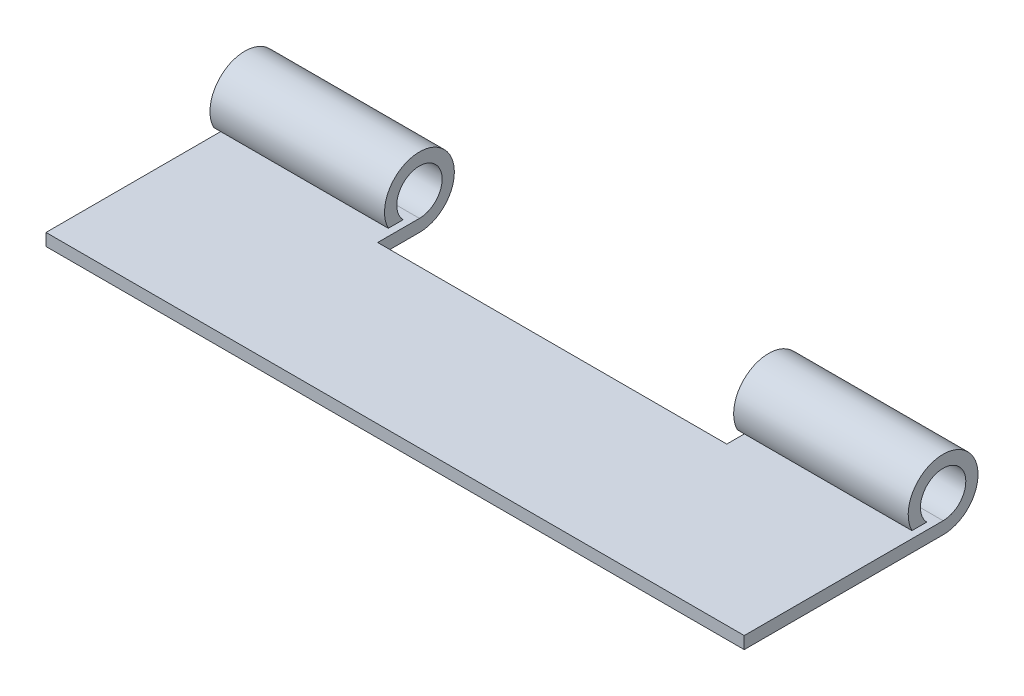
ISO-10303-21;
HEADER;
FILE_DESCRIPTION(('STEP AP214'),'2;1');
FILE_NAME('part.step','',(''),(''),'','','');
FILE_SCHEMA(('AUTOMOTIVE_DESIGN { 1 0 10303 214 1 1 1 1 }'));
ENDSEC;
DATA;
#1=APPLICATION_CONTEXT('core data for automotive mechanical design processes');
#2=APPLICATION_PROTOCOL_DEFINITION('international standard','automotive_design',2000,#1);
#3=PRODUCT_CONTEXT('',#1,'mechanical');
#4=PRODUCT('Part','Part','',(#3));
#5=PRODUCT_RELATED_PRODUCT_CATEGORY('part','',(#4));
#6=PRODUCT_DEFINITION_FORMATION('','',#4);
#7=PRODUCT_DEFINITION_CONTEXT('part definition',#1,'design');
#8=PRODUCT_DEFINITION('design','',#6,#7);
#9=PRODUCT_DEFINITION_SHAPE('','',#8);
#10=(LENGTH_UNIT() NAMED_UNIT(*) SI_UNIT(.MILLI.,.METRE.));
#11=(NAMED_UNIT(*) PLANE_ANGLE_UNIT() SI_UNIT($,.RADIAN.));
#12=(NAMED_UNIT(*) SI_UNIT($,.STERADIAN.) SOLID_ANGLE_UNIT());
#13=UNCERTAINTY_MEASURE_WITH_UNIT(LENGTH_MEASURE(1.E-05),#10,'distance_accuracy_value','');
#14=(GEOMETRIC_REPRESENTATION_CONTEXT(3) GLOBAL_UNCERTAINTY_ASSIGNED_CONTEXT((#13)) GLOBAL_UNIT_ASSIGNED_CONTEXT((#10,
#11,#12)) REPRESENTATION_CONTEXT('',''));
#15=CARTESIAN_POINT('',(0.,0.,0.));
#16=DIRECTION('',(0.,0.,1.));
#17=DIRECTION('',(1.,0.,0.));
#18=AXIS2_PLACEMENT_3D('',#15,#16,#17);
#19=CARTESIAN_POINT('',(0.,0.889,0.));
#20=DIRECTION('',(1.,0.,0.));
#21=DIRECTION('',(0.,0.,-1.));
#22=AXIS2_PLACEMENT_3D('',#19,#20,#21);
#23=PLANE('',#22);
#24=DIRECTION('',(0.,0.,1.));
#25=VECTOR('',#24,1.);
#26=CARTESIAN_POINT('',(0.,0.,0.));
#27=LINE('',#26,#25);
#28=CARTESIAN_POINT('',(0.,0.,-18.9150541552965));
#29=VERTEX_POINT('',#28);
#30=CARTESIAN_POINT('',(0.,0.,-4.445));
#31=VERTEX_POINT('',#30);
#32=EDGE_CURVE('E240',#29,#31,#27,.T.);
#33=ORIENTED_EDGE('',*,*,#32,.T.);
#34=DIRECTION('',(0.,1.,0.));
#35=VECTOR('',#34,1.);
#36=CARTESIAN_POINT('',(0.,6.34032173325027,-4.445));
#37=LINE('',#36,#35);
#38=CARTESIAN_POINT('',(0.,0.889,-4.445));
#39=VERTEX_POINT('',#38);
#40=EDGE_CURVE('E230',#31,#39,#37,.T.);
#41=ORIENTED_EDGE('',*,*,#40,.T.);
#42=DIRECTION('',(0.,0.,1.));
#43=VECTOR('',#42,1.);
#44=CARTESIAN_POINT('',(0.,0.889,0.));
#45=LINE('',#44,#43);
#46=CARTESIAN_POINT('',(0.,0.889000000000001,-18.9150541552965));
#47=VERTEX_POINT('',#46);
#48=EDGE_CURVE('E241',#47,#39,#45,.T.);
#49=ORIENTED_EDGE('',*,*,#48,.F.);
#50=CARTESIAN_POINT('',(0.,2.54,-18.9150541552965));
#51=DIRECTION('',(1.,0.,0.));
#52=DIRECTION('',(0.,0.,-1.));
#53=AXIS2_PLACEMENT_3D('',#50,#51,#52);
#54=CIRCLE('',#53,1.651);
#55=CARTESIAN_POINT('',(0.,1.397,-17.7236885523013));
#56=VERTEX_POINT('',#55);
#57=EDGE_CURVE('E173',#47,#56,#54,.T.);
#58=ORIENTED_EDGE('',*,*,#57,.T.);
#59=DIRECTION('',(0.,0.,1.));
#60=VECTOR('',#59,1.);
#61=CARTESIAN_POINT('',(0.,1.397,-16.646761625661));
#62=LINE('',#61,#60);
#63=CARTESIAN_POINT('',(0.,1.397,-16.646761625661));
#64=VERTEX_POINT('',#63);
#65=EDGE_CURVE('E179',#56,#64,#62,.T.);
#66=ORIENTED_EDGE('',*,*,#65,.T.);
#67=CARTESIAN_POINT('',(0.,2.54,-18.9150541552965));
#68=DIRECTION('',(1.,0.,0.));
#69=DIRECTION('',(0.,0.,-1.));
#70=AXIS2_PLACEMENT_3D('',#67,#68,#69);
#71=CIRCLE('',#70,2.54);
#72=EDGE_CURVE('E136',#64,#29,#71,.F.);
#73=ORIENTED_EDGE('',*,*,#72,.T.);
#74=EDGE_LOOP('',(#33,#41,#49,#58,#66,#73));
#75=FACE_BOUND('',#74,.T.);
#76=ADVANCED_FACE('F39',(#75),#23,.F.);
#77=CARTESIAN_POINT('',(50.8,0.889,0.));
#78=DIRECTION('',(-1.,0.,0.));
#79=DIRECTION('',(0.,0.,1.));
#80=AXIS2_PLACEMENT_3D('',#77,#78,#79);
#81=PLANE('',#80);
#82=DIRECTION('',(0.,0.,-1.));
#83=VECTOR('',#82,1.);
#84=CARTESIAN_POINT('',(50.8,0.889,0.));
#85=LINE('',#84,#83);
#86=CARTESIAN_POINT('',(50.8,0.889,-4.445));
#87=VERTEX_POINT('',#86);
#88=CARTESIAN_POINT('',(50.8,0.889000000000001,-18.9150541552965));
#89=VERTEX_POINT('',#88);
#90=EDGE_CURVE('E245',#87,#89,#85,.T.);
#91=ORIENTED_EDGE('',*,*,#90,.F.);
#92=DIRECTION('',(0.,1.,0.));
#93=VECTOR('',#92,1.);
#94=CARTESIAN_POINT('',(50.8,6.34032173325027,-4.445));
#95=LINE('',#94,#93);
#96=CARTESIAN_POINT('',(50.8,0.,-4.445));
#97=VERTEX_POINT('',#96);
#98=EDGE_CURVE('E229',#97,#87,#95,.T.);
#99=ORIENTED_EDGE('',*,*,#98,.F.);
#100=DIRECTION('',(0.,0.,-1.));
#101=VECTOR('',#100,1.);
#102=CARTESIAN_POINT('',(50.8,0.,0.));
#103=LINE('',#102,#101);
#104=CARTESIAN_POINT('',(50.8,0.,-18.9150541552965));
#105=VERTEX_POINT('',#104);
#106=EDGE_CURVE('E253',#97,#105,#103,.T.);
#107=ORIENTED_EDGE('',*,*,#106,.T.);
#108=CARTESIAN_POINT('',(50.8,2.54,-18.9150541552965));
#109=DIRECTION('',(-1.,0.,0.));
#110=DIRECTION('',(0.,0.,1.));
#111=AXIS2_PLACEMENT_3D('',#108,#109,#110);
#112=CIRCLE('',#111,2.54);
#113=CARTESIAN_POINT('',(50.8,1.397,-16.646761625661));
#114=VERTEX_POINT('',#113);
#115=EDGE_CURVE('E187',#114,#105,#112,.T.);
#116=ORIENTED_EDGE('',*,*,#115,.F.);
#117=DIRECTION('',(0.,0.,1.));
#118=VECTOR('',#117,1.);
#119=CARTESIAN_POINT('',(50.8,1.397,-16.646761625661));
#120=LINE('',#119,#118);
#121=CARTESIAN_POINT('',(50.8,1.397,-17.7236885523013));
#122=VERTEX_POINT('',#121);
#123=EDGE_CURVE('E183',#122,#114,#120,.T.);
#124=ORIENTED_EDGE('',*,*,#123,.F.);
#125=CARTESIAN_POINT('',(50.8,2.54,-18.9150541552965));
#126=DIRECTION('',(-1.,0.,0.));
#127=DIRECTION('',(0.,0.,1.));
#128=AXIS2_PLACEMENT_3D('',#125,#126,#127);
#129=CIRCLE('',#128,1.651);
#130=EDGE_CURVE('E192',#122,#89,#129,.T.);
#131=ORIENTED_EDGE('',*,*,#130,.T.);
#132=EDGE_LOOP('',(#91,#99,#107,#116,#124,#131));
#133=FACE_BOUND('',#132,.T.);
#134=ADVANCED_FACE('F279',(#133),#81,.F.);
#135=CARTESIAN_POINT('',(0.,0.889,-15.875));
#136=DIRECTION('',(0.,0.,1.));
#137=DIRECTION('',(1.,0.,0.));
#138=AXIS2_PLACEMENT_3D('',#135,#136,#137);
#139=PLANE('',#138);
#140=DIRECTION('',(-1.,0.,0.));
#141=VECTOR('',#140,1.);
#142=CARTESIAN_POINT('',(0.,0.,-15.875));
#143=LINE('',#142,#141);
#144=CARTESIAN_POINT('',(38.1,0.,-15.875));
#145=VERTEX_POINT('',#144);
#146=CARTESIAN_POINT('',(12.7,0.,-15.875));
#147=VERTEX_POINT('',#146);
#148=EDGE_CURVE('E59',#145,#147,#143,.T.);
#149=ORIENTED_EDGE('',*,*,#148,.T.);
#150=DIRECTION('',(0.,-1.,0.));
#151=VECTOR('',#150,1.);
#152=CARTESIAN_POINT('',(12.7,0.889,-15.875));
#153=LINE('',#152,#151);
#154=CARTESIAN_POINT('',(12.7,0.889,-15.875));
#155=VERTEX_POINT('',#154);
#156=EDGE_CURVE('E54',#155,#147,#153,.T.);
#157=ORIENTED_EDGE('',*,*,#156,.F.);
#158=DIRECTION('',(-1.,0.,0.));
#159=VECTOR('',#158,1.);
#160=CARTESIAN_POINT('',(0.,0.889,-15.875));
#161=LINE('',#160,#159);
#162=CARTESIAN_POINT('',(38.1,0.889,-15.875));
#163=VERTEX_POINT('',#162);
#164=EDGE_CURVE('E47',#163,#155,#161,.T.);
#165=ORIENTED_EDGE('',*,*,#164,.F.);
#166=DIRECTION('',(0.,-1.,0.));
#167=VECTOR('',#166,1.);
#168=CARTESIAN_POINT('',(38.1,0.889,-15.875));
#169=LINE('',#168,#167);
#170=EDGE_CURVE('E212',#163,#145,#169,.T.);
#171=ORIENTED_EDGE('',*,*,#170,.T.);
#172=EDGE_LOOP('',(#149,#157,#165,#171));
#173=FACE_BOUND('',#172,.T.);
#174=ADVANCED_FACE('F267',(#173),#139,.F.);
#175=CARTESIAN_POINT('',(0.,0.889,0.));
#176=DIRECTION('',(0.,-1.,0.));
#177=DIRECTION('',(0.,0.,-1.));
#178=AXIS2_PLACEMENT_3D('',#175,#176,#177);
#179=PLANE('',#178);
#180=ORIENTED_EDGE('',*,*,#48,.T.);
#181=DIRECTION('',(1.,0.,0.));
#182=VECTOR('',#181,1.);
#183=CARTESIAN_POINT('',(0.,0.889,-4.445));
#184=LINE('',#183,#182);
#185=EDGE_CURVE('E234',#39,#87,#184,.T.);
#186=ORIENTED_EDGE('',*,*,#185,.T.);
#187=ORIENTED_EDGE('',*,*,#90,.T.);
#188=DIRECTION('',(-1.,0.,0.));
#189=VECTOR('',#188,1.);
#190=CARTESIAN_POINT('',(58.3460853676619,0.889000000000001,-18.9150541552965));
#191=LINE('',#190,#189);
#192=CARTESIAN_POINT('',(38.1,0.889000000000001,-18.9150541552965));
#193=VERTEX_POINT('',#192);
#194=EDGE_CURVE('E215',#89,#193,#191,.T.);
#195=ORIENTED_EDGE('',*,*,#194,.T.);
#196=DIRECTION('',(0.,0.,-1.));
#197=VECTOR('',#196,1.);
#198=CARTESIAN_POINT('',(38.1,0.889,-15.875));
#199=LINE('',#198,#197);
#200=EDGE_CURVE('E182',#163,#193,#199,.T.);
#201=ORIENTED_EDGE('',*,*,#200,.F.);
#202=ORIENTED_EDGE('',*,*,#164,.T.);
#203=DIRECTION('',(0.,0.,1.));
#204=VECTOR('',#203,1.);
#205=CARTESIAN_POINT('',(12.7,0.889,-15.875));
#206=LINE('',#205,#204);
#207=CARTESIAN_POINT('',(12.7,0.889,-18.9150541552965));
#208=VERTEX_POINT('',#207);
#209=EDGE_CURVE('E162',#208,#155,#206,.T.);
#210=ORIENTED_EDGE('',*,*,#209,.F.);
#211=DIRECTION('',(1.,0.,0.));
#212=VECTOR('',#211,1.);
#213=CARTESIAN_POINT('',(-7.54608536766194,0.889,-18.9150541552965));
#214=LINE('',#213,#212);
#215=EDGE_CURVE('E174',#47,#208,#214,.T.);
#216=ORIENTED_EDGE('',*,*,#215,.F.);
#217=EDGE_LOOP('',(#180,#186,#187,#195,#201,#202,#210,#216));
#218=FACE_BOUND('',#217,.T.);
#219=ADVANCED_FACE('F265',(#218),#179,.F.);
#220=CARTESIAN_POINT('',(0.,0.,0.));
#221=DIRECTION('',(0.,-1.,0.));
#222=DIRECTION('',(0.,0.,-1.));
#223=AXIS2_PLACEMENT_3D('',#220,#221,#222);
#224=PLANE('',#223);
#225=DIRECTION('',(1.,0.,0.));
#226=VECTOR('',#225,1.);
#227=CARTESIAN_POINT('',(0.,0.,-4.445));
#228=LINE('',#227,#226);
#229=EDGE_CURVE('E11',#31,#97,#228,.T.);
#230=ORIENTED_EDGE('',*,*,#229,.F.);
#231=ORIENTED_EDGE('',*,*,#32,.F.);
#232=DIRECTION('',(1.,0.,0.));
#233=VECTOR('',#232,1.);
#234=CARTESIAN_POINT('',(-7.54608536766194,0.,-18.9150541552965));
#235=LINE('',#234,#233);
#236=CARTESIAN_POINT('',(12.7,0.,-18.9150541552965));
#237=VERTEX_POINT('',#236);
#238=EDGE_CURVE('E170',#29,#237,#235,.T.);
#239=ORIENTED_EDGE('',*,*,#238,.T.);
#240=DIRECTION('',(0.,0.,-1.));
#241=VECTOR('',#240,1.);
#242=CARTESIAN_POINT('',(12.7,0.,-15.875));
#243=LINE('',#242,#241);
#244=EDGE_CURVE('E141',#147,#237,#243,.T.);
#245=ORIENTED_EDGE('',*,*,#244,.F.);
#246=ORIENTED_EDGE('',*,*,#148,.F.);
#247=DIRECTION('',(0.,0.,-1.));
#248=VECTOR('',#247,1.);
#249=CARTESIAN_POINT('',(38.1,0.,-15.875));
#250=LINE('',#249,#248);
#251=CARTESIAN_POINT('',(38.1,0.,-18.9150541552965));
#252=VERTEX_POINT('',#251);
#253=EDGE_CURVE('E208',#145,#252,#250,.T.);
#254=ORIENTED_EDGE('',*,*,#253,.T.);
#255=DIRECTION('',(-1.,0.,0.));
#256=VECTOR('',#255,1.);
#257=CARTESIAN_POINT('',(58.3460853676619,0.,-18.9150541552965));
#258=LINE('',#257,#256);
#259=EDGE_CURVE('E188',#105,#252,#258,.T.);
#260=ORIENTED_EDGE('',*,*,#259,.F.);
#261=ORIENTED_EDGE('',*,*,#106,.F.);
#262=EDGE_LOOP('',(#230,#231,#239,#245,#246,#254,#260,#261));
#263=FACE_BOUND('',#262,.T.);
#264=ADVANCED_FACE('F271',(#263),#224,.T.);
#265=CARTESIAN_POINT('',(0.,6.34032173325027,-4.445));
#266=DIRECTION('',(0.,0.,-1.));
#267=DIRECTION('',(0.,1.,0.));
#268=AXIS2_PLACEMENT_3D('',#265,#266,#267);
#269=PLANE('',#268);
#270=ORIENTED_EDGE('',*,*,#40,.F.);
#271=ORIENTED_EDGE('',*,*,#229,.T.);
#272=ORIENTED_EDGE('',*,*,#98,.T.);
#273=ORIENTED_EDGE('',*,*,#185,.F.);
#274=EDGE_LOOP('',(#270,#271,#272,#273));
#275=FACE_BOUND('',#274,.T.);
#276=ADVANCED_FACE('F309',(#275),#269,.F.);
#277=CARTESIAN_POINT('',(58.3460853676619,2.54,-18.9150541552965));
#278=DIRECTION('',(-1.,0.,0.));
#279=DIRECTION('',(0.,0.,1.));
#280=AXIS2_PLACEMENT_3D('',#277,#278,#279);
#281=CYLINDRICAL_SURFACE('',#280,2.54);
#282=DIRECTION('',(-1.,0.,0.));
#283=VECTOR('',#282,1.);
#284=CARTESIAN_POINT('',(58.3460853676619,1.397,-16.646761625661));
#285=LINE('',#284,#283);
#286=CARTESIAN_POINT('',(38.1,1.397,-16.646761625661));
#287=VERTEX_POINT('',#286);
#288=EDGE_CURVE('E218',#114,#287,#285,.T.);
#289=ORIENTED_EDGE('',*,*,#288,.F.);
#290=ORIENTED_EDGE('',*,*,#115,.T.);
#291=ORIENTED_EDGE('',*,*,#259,.T.);
#292=CARTESIAN_POINT('',(38.1,2.54,-18.9150541552965));
#293=DIRECTION('',(1.,0.,0.));
#294=DIRECTION('',(0.,0.,-1.));
#295=AXIS2_PLACEMENT_3D('',#292,#293,#294);
#296=CIRCLE('',#295,2.54);
#297=EDGE_CURVE('E204',#252,#287,#296,.T.);
#298=ORIENTED_EDGE('',*,*,#297,.T.);
#299=EDGE_LOOP('',(#289,#290,#291,#298));
#300=FACE_BOUND('',#299,.T.);
#301=ADVANCED_FACE('F313',(#300),#281,.T.);
#302=CARTESIAN_POINT('',(58.3460853676619,1.397,-16.646761625661));
#303=DIRECTION('',(0.,1.,0.));
#304=DIRECTION('',(0.,0.,1.));
#305=AXIS2_PLACEMENT_3D('',#302,#303,#304);
#306=PLANE('',#305);
#307=DIRECTION('',(-1.,0.,0.));
#308=VECTOR('',#307,1.);
#309=CARTESIAN_POINT('',(58.3460853676619,1.397,-17.7236885523013));
#310=LINE('',#309,#308);
#311=CARTESIAN_POINT('',(38.1,1.397,-17.7236885523013));
#312=VERTEX_POINT('',#311);
#313=EDGE_CURVE('E221',#122,#312,#310,.T.);
#314=ORIENTED_EDGE('',*,*,#313,.F.);
#315=ORIENTED_EDGE('',*,*,#123,.T.);
#316=ORIENTED_EDGE('',*,*,#288,.T.);
#317=DIRECTION('',(0.,0.,-1.));
#318=VECTOR('',#317,1.);
#319=CARTESIAN_POINT('',(38.1,1.397,-16.646761625661));
#320=LINE('',#319,#318);
#321=EDGE_CURVE('E200',#287,#312,#320,.T.);
#322=ORIENTED_EDGE('',*,*,#321,.T.);
#323=EDGE_LOOP('',(#314,#315,#316,#322));
#324=FACE_BOUND('',#323,.T.);
#325=ADVANCED_FACE('F295',(#324),#306,.F.);
#326=CARTESIAN_POINT('',(58.3460853676619,2.54,-18.9150541552965));
#327=DIRECTION('',(-1.,0.,0.));
#328=DIRECTION('',(0.,0.,1.));
#329=AXIS2_PLACEMENT_3D('',#326,#327,#328);
#330=CYLINDRICAL_SURFACE('',#329,1.651);
#331=ORIENTED_EDGE('',*,*,#130,.F.);
#332=ORIENTED_EDGE('',*,*,#313,.T.);
#333=CARTESIAN_POINT('',(38.1,2.54,-18.9150541552965));
#334=DIRECTION('',(1.,0.,0.));
#335=DIRECTION('',(0.,0.,-1.));
#336=AXIS2_PLACEMENT_3D('',#333,#334,#335);
#337=CIRCLE('',#336,1.651);
#338=EDGE_CURVE('E196',#193,#312,#337,.T.);
#339=ORIENTED_EDGE('',*,*,#338,.F.);
#340=ORIENTED_EDGE('',*,*,#194,.F.);
#341=EDGE_LOOP('',(#331,#332,#339,#340));
#342=FACE_BOUND('',#341,.T.);
#343=ADVANCED_FACE('F285',(#342),#330,.F.);
#344=CARTESIAN_POINT('',(38.1,2.54,-18.9150541552965));
#345=DIRECTION('',(1.,0.,0.));
#346=DIRECTION('',(0.,0.,-1.));
#347=AXIS2_PLACEMENT_3D('',#344,#345,#346);
#348=PLANE('',#347);
#349=ORIENTED_EDGE('',*,*,#200,.T.);
#350=ORIENTED_EDGE('',*,*,#338,.T.);
#351=ORIENTED_EDGE('',*,*,#321,.F.);
#352=ORIENTED_EDGE('',*,*,#297,.F.);
#353=ORIENTED_EDGE('',*,*,#253,.F.);
#354=ORIENTED_EDGE('',*,*,#170,.F.);
#355=EDGE_LOOP('',(#349,#350,#351,#352,#353,#354));
#356=FACE_BOUND('',#355,.T.);
#357=ADVANCED_FACE('F287',(#356),#348,.F.);
#358=CARTESIAN_POINT('',(-7.54608536766194,2.54,-18.9150541552965));
#359=DIRECTION('',(1.,0.,0.));
#360=DIRECTION('',(0.,0.,-1.));
#361=AXIS2_PLACEMENT_3D('',#358,#359,#360);
#362=CYLINDRICAL_SURFACE('',#361,2.54);
#363=ORIENTED_EDGE('',*,*,#72,.F.);
#364=DIRECTION('',(1.,0.,0.));
#365=VECTOR('',#364,1.);
#366=CARTESIAN_POINT('',(-7.54608536766194,1.397,-16.646761625661));
#367=LINE('',#366,#365);
#368=CARTESIAN_POINT('',(12.7,1.397,-16.646761625661));
#369=VERTEX_POINT('',#368);
#370=EDGE_CURVE('E128',#64,#369,#367,.T.);
#371=ORIENTED_EDGE('',*,*,#370,.T.);
#372=CARTESIAN_POINT('',(12.7,2.54,-18.9150541552965));
#373=DIRECTION('',(1.,0.,0.));
#374=DIRECTION('',(0.,0.,-1.));
#375=AXIS2_PLACEMENT_3D('',#372,#373,#374);
#376=CIRCLE('',#375,2.54);
#377=EDGE_CURVE('E133',#237,#369,#376,.T.);
#378=ORIENTED_EDGE('',*,*,#377,.F.);
#379=ORIENTED_EDGE('',*,*,#238,.F.);
#380=EDGE_LOOP('',(#363,#371,#378,#379));
#381=FACE_BOUND('',#380,.T.);
#382=ADVANCED_FACE('F130',(#381),#362,.T.);
#383=CARTESIAN_POINT('',(-7.54608536766194,2.54,-18.9150541552965));
#384=DIRECTION('',(1.,0.,0.));
#385=DIRECTION('',(0.,0.,-1.));
#386=AXIS2_PLACEMENT_3D('',#383,#384,#385);
#387=CYLINDRICAL_SURFACE('',#386,1.651);
#388=ORIENTED_EDGE('',*,*,#57,.F.);
#389=ORIENTED_EDGE('',*,*,#215,.T.);
#390=CARTESIAN_POINT('',(12.7,2.54,-18.9150541552965));
#391=DIRECTION('',(-1.,0.,0.));
#392=DIRECTION('',(0.,0.,-1.));
#393=AXIS2_PLACEMENT_3D('',#390,#391,#392);
#394=CIRCLE('',#393,1.651);
#395=CARTESIAN_POINT('',(12.7,1.397,-17.7236885523013));
#396=VERTEX_POINT('',#395);
#397=EDGE_CURVE('E151',#396,#208,#394,.T.);
#398=ORIENTED_EDGE('',*,*,#397,.F.);
#399=DIRECTION('',(1.,0.,0.));
#400=VECTOR('',#399,1.);
#401=CARTESIAN_POINT('',(-7.54608536766194,1.397,-17.7236885523013));
#402=LINE('',#401,#400);
#403=EDGE_CURVE('E140',#56,#396,#402,.T.);
#404=ORIENTED_EDGE('',*,*,#403,.F.);
#405=EDGE_LOOP('',(#388,#389,#398,#404));
#406=FACE_BOUND('',#405,.T.);
#407=ADVANCED_FACE('F262',(#406),#387,.F.);
#408=CARTESIAN_POINT('',(-7.54608536766194,1.397,-16.646761625661));
#409=DIRECTION('',(0.,-1.,0.));
#410=DIRECTION('',(0.,0.,-1.));
#411=AXIS2_PLACEMENT_3D('',#408,#409,#410);
#412=PLANE('',#411);
#413=ORIENTED_EDGE('',*,*,#65,.F.);
#414=ORIENTED_EDGE('',*,*,#403,.T.);
#415=DIRECTION('',(0.,0.,-1.));
#416=VECTOR('',#415,1.);
#417=CARTESIAN_POINT('',(12.7,1.397,-16.646761625661));
#418=LINE('',#417,#416);
#419=EDGE_CURVE('E144',#369,#396,#418,.T.);
#420=ORIENTED_EDGE('',*,*,#419,.F.);
#421=ORIENTED_EDGE('',*,*,#370,.F.);
#422=EDGE_LOOP('',(#413,#414,#420,#421));
#423=FACE_BOUND('',#422,.T.);
#424=ADVANCED_FACE('F145',(#423),#412,.T.);
#425=CARTESIAN_POINT('',(12.7,2.54,-18.9150541552965));
#426=DIRECTION('',(1.,0.,0.));
#427=DIRECTION('',(0.,0.,-1.));
#428=AXIS2_PLACEMENT_3D('',#425,#426,#427);
#429=PLANE('',#428);
#430=ORIENTED_EDGE('',*,*,#377,.T.);
#431=ORIENTED_EDGE('',*,*,#419,.T.);
#432=ORIENTED_EDGE('',*,*,#397,.T.);
#433=ORIENTED_EDGE('',*,*,#209,.T.);
#434=ORIENTED_EDGE('',*,*,#156,.T.);
#435=ORIENTED_EDGE('',*,*,#244,.T.);
#436=EDGE_LOOP('',(#430,#431,#432,#433,#434,#435));
#437=FACE_BOUND('',#436,.T.);
#438=ADVANCED_FACE('F153',(#437),#429,.T.);
#439=CLOSED_SHELL('',(#76,#134,#174,#219,#264,#276,#301,#325,#343,#357,#382,#407,#424,#438));
#440=MANIFOLD_SOLID_BREP('B2',#439);
#441=ADVANCED_BREP_SHAPE_REPRESENTATION('',(#18,#440),#14);
#442=SHAPE_DEFINITION_REPRESENTATION(#9,#441);
ENDSEC;
END-ISO-10303-21;
